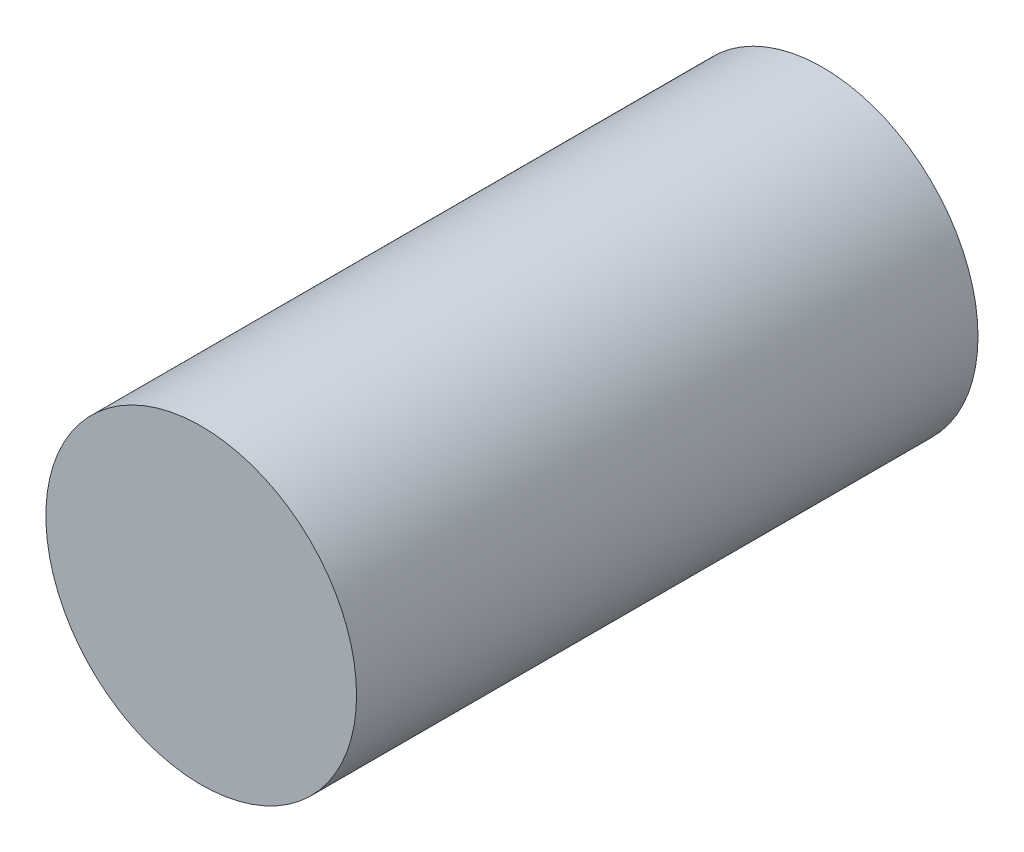
ISO-10303-21;
HEADER;
FILE_DESCRIPTION(('STEP AP214'),'2;1');
FILE_NAME('part.step','',(''),(''),'','','');
FILE_SCHEMA(('AUTOMOTIVE_DESIGN { 1 0 10303 214 1 1 1 1 }'));
ENDSEC;
DATA;
#1=APPLICATION_CONTEXT('core data for automotive mechanical design processes');
#2=APPLICATION_PROTOCOL_DEFINITION('international standard','automotive_design',2000,#1);
#3=PRODUCT_CONTEXT('',#1,'mechanical');
#4=PRODUCT('Part','Part','',(#3));
#5=PRODUCT_RELATED_PRODUCT_CATEGORY('part','',(#4));
#6=PRODUCT_DEFINITION_FORMATION('','',#4);
#7=PRODUCT_DEFINITION_CONTEXT('part definition',#1,'design');
#8=PRODUCT_DEFINITION('design','',#6,#7);
#9=PRODUCT_DEFINITION_SHAPE('','',#8);
#10=(LENGTH_UNIT() NAMED_UNIT(*) SI_UNIT(.MILLI.,.METRE.));
#11=(NAMED_UNIT(*) PLANE_ANGLE_UNIT() SI_UNIT($,.RADIAN.));
#12=(NAMED_UNIT(*) SI_UNIT($,.STERADIAN.) SOLID_ANGLE_UNIT());
#13=UNCERTAINTY_MEASURE_WITH_UNIT(LENGTH_MEASURE(1.E-05),#10,'distance_accuracy_value','');
#14=(GEOMETRIC_REPRESENTATION_CONTEXT(3) GLOBAL_UNCERTAINTY_ASSIGNED_CONTEXT((#13)) GLOBAL_UNIT_ASSIGNED_CONTEXT((#10,
#11,#12)) REPRESENTATION_CONTEXT('',''));
#15=CARTESIAN_POINT('',(0.,0.,0.));
#16=DIRECTION('',(0.,0.,1.));
#17=DIRECTION('',(1.,0.,0.));
#18=AXIS2_PLACEMENT_3D('',#15,#16,#17);
#19=CARTESIAN_POINT('',(0.,0.,2.00000108));
#20=DIRECTION('',(0.,0.,1.));
#21=DIRECTION('',(1.,0.,0.));
#22=AXIS2_PLACEMENT_3D('',#19,#20,#21);
#23=PLANE('',#22);
#24=CARTESIAN_POINT('',(0.,0.,2.00000108));
#25=DIRECTION('',(0.,0.,1.));
#26=DIRECTION('',(1.,0.,0.));
#27=AXIS2_PLACEMENT_3D('',#24,#25,#26);
#28=CIRCLE('',#27,0.499999);
#29=CARTESIAN_POINT('',(0.499999,0.,2.00000108));
#30=VERTEX_POINT('',#29);
#31=EDGE_CURVE('E11',#30,#30,#28,.T.);
#32=ORIENTED_EDGE('',*,*,#31,.T.);
#33=EDGE_LOOP('',(#32));
#34=FACE_BOUND('',#33,.T.);
#35=ADVANCED_FACE('F17',(#34),#23,.T.);
#36=CARTESIAN_POINT('',(0.,0.,0.));
#37=DIRECTION('',(0.,0.,1.));
#38=DIRECTION('',(1.,0.,0.));
#39=AXIS2_PLACEMENT_3D('',#36,#37,#38);
#40=PLANE('',#39);
#41=CARTESIAN_POINT('',(0.,0.,0.));
#42=DIRECTION('',(0.,0.,1.));
#43=DIRECTION('',(1.,0.,0.));
#44=AXIS2_PLACEMENT_3D('',#41,#42,#43);
#45=CIRCLE('',#44,0.499999);
#46=CARTESIAN_POINT('',(0.499999,0.,0.));
#47=VERTEX_POINT('',#46);
#48=EDGE_CURVE('E42',#47,#47,#45,.T.);
#49=ORIENTED_EDGE('',*,*,#48,.F.);
#50=EDGE_LOOP('',(#49));
#51=FACE_BOUND('',#50,.T.);
#52=ADVANCED_FACE('F64',(#51),#40,.F.);
#53=CARTESIAN_POINT('',(0.,0.,0.));
#54=DIRECTION('',(0.,0.,-1.));
#55=DIRECTION('',(1.,0.,0.));
#56=AXIS2_PLACEMENT_3D('',#53,#54,#55);
#57=CYLINDRICAL_SURFACE('',#56,0.499999);
#58=ORIENTED_EDGE('',*,*,#48,.T.);
#59=DIRECTION('',(0.,0.,1.));
#60=VECTOR('',#59,1.);
#61=CARTESIAN_POINT('',(0.499999,0.,0.));
#62=LINE('',#61,#60);
#63=EDGE_CURVE('E25',#47,#30,#62,.T.);
#64=ORIENTED_EDGE('',*,*,#63,.T.);
#65=ORIENTED_EDGE('',*,*,#31,.F.);
#66=ORIENTED_EDGE('',*,*,#63,.F.);
#67=EDGE_LOOP('',(#58,#64,#65,#66));
#68=FACE_BOUND('',#67,.T.);
#69=ADVANCED_FACE('F40',(#68),#57,.T.);
#70=CLOSED_SHELL('',(#35,#52,#69));
#71=MANIFOLD_SOLID_BREP('B1',#70);
#72=ADVANCED_BREP_SHAPE_REPRESENTATION('',(#18,#71),#14);
#73=SHAPE_DEFINITION_REPRESENTATION(#9,#72);
ENDSEC;
END-ISO-10303-21;
